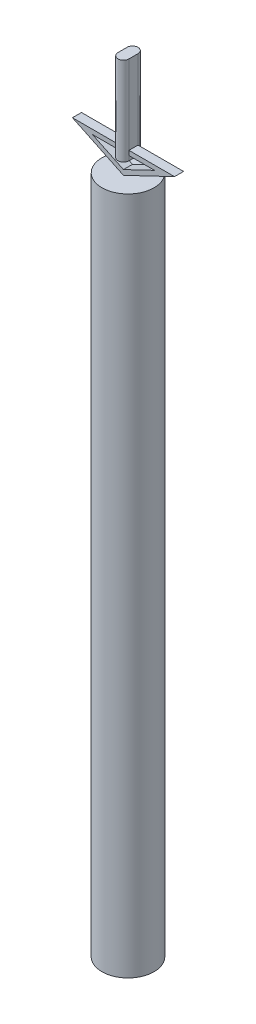
ISO-10303-21;
HEADER;
FILE_DESCRIPTION(('STEP AP214'),'2;1');
FILE_NAME('part.step','',(''),(''),'','','');
FILE_SCHEMA(('AUTOMOTIVE_DESIGN { 1 0 10303 214 1 1 1 1 }'));
ENDSEC;
DATA;
#1=APPLICATION_CONTEXT('core data for automotive mechanical design processes');
#2=APPLICATION_PROTOCOL_DEFINITION('international standard','automotive_design',2000,#1);
#3=PRODUCT_CONTEXT('',#1,'mechanical');
#4=PRODUCT('Part','Part','',(#3));
#5=PRODUCT_RELATED_PRODUCT_CATEGORY('part','',(#4));
#6=PRODUCT_DEFINITION_FORMATION('','',#4);
#7=PRODUCT_DEFINITION_CONTEXT('part definition',#1,'design');
#8=PRODUCT_DEFINITION('design','',#6,#7);
#9=PRODUCT_DEFINITION_SHAPE('','',#8);
#10=(LENGTH_UNIT() NAMED_UNIT(*) SI_UNIT(.MILLI.,.METRE.));
#11=(NAMED_UNIT(*) PLANE_ANGLE_UNIT() SI_UNIT($,.RADIAN.));
#12=(NAMED_UNIT(*) SI_UNIT($,.STERADIAN.) SOLID_ANGLE_UNIT());
#13=UNCERTAINTY_MEASURE_WITH_UNIT(LENGTH_MEASURE(1.E-05),#10,'distance_accuracy_value','');
#14=(GEOMETRIC_REPRESENTATION_CONTEXT(3) GLOBAL_UNCERTAINTY_ASSIGNED_CONTEXT((#13)) GLOBAL_UNIT_ASSIGNED_CONTEXT((#10,
#11,#12)) REPRESENTATION_CONTEXT('',''));
#15=CARTESIAN_POINT('',(0.,0.,0.));
#16=DIRECTION('',(0.,0.,1.));
#17=DIRECTION('',(1.,0.,0.));
#18=AXIS2_PLACEMENT_3D('',#15,#16,#17);
#19=CARTESIAN_POINT('',(-22.5568727923833,310.779030096824,-2.));
#20=DIRECTION('',(0.,1.,0.));
#21=DIRECTION('',(0.,0.,1.));
#22=AXIS2_PLACEMENT_3D('',#19,#20,#21);
#23=PLANE('',#22);
#24=DIRECTION('',(0.,0.,-1.));
#25=VECTOR('',#24,1.);
#26=CARTESIAN_POINT('',(2.42644500089359,310.779030096824,-2.));
#27=LINE('',#26,#25);
#28=CARTESIAN_POINT('',(2.42644500089359,310.779030096824,2.));
#29=VERTEX_POINT('',#28);
#30=CARTESIAN_POINT('',(2.42644500089359,310.779030096824,-2.));
#31=VERTEX_POINT('',#30);
#32=EDGE_CURVE('E205',#29,#31,#27,.T.);
#33=ORIENTED_EDGE('',*,*,#32,.F.);
#34=DIRECTION('',(-1.,0.,0.));
#35=VECTOR('',#34,1.);
#36=CARTESIAN_POINT('',(-22.5568727923833,310.779030096824,2.));
#37=LINE('',#36,#35);
#38=CARTESIAN_POINT('',(22.5568727923833,310.779030096824,2.));
#39=VERTEX_POINT('',#38);
#40=EDGE_CURVE('E221',#39,#29,#37,.T.);
#41=ORIENTED_EDGE('',*,*,#40,.F.);
#42=DIRECTION('',(0.,0.,1.));
#43=VECTOR('',#42,1.);
#44=CARTESIAN_POINT('',(22.5568727923833,310.779030096824,-2.));
#45=LINE('',#44,#43);
#46=CARTESIAN_POINT('',(22.5568727923833,310.779030096824,-2.));
#47=VERTEX_POINT('',#46);
#48=EDGE_CURVE('E254',#47,#39,#45,.T.);
#49=ORIENTED_EDGE('',*,*,#48,.F.);
#50=DIRECTION('',(-1.,0.,0.));
#51=VECTOR('',#50,1.);
#52=CARTESIAN_POINT('',(-22.5568727923833,310.779030096824,-2.));
#53=LINE('',#52,#51);
#54=EDGE_CURVE('E248',#47,#31,#53,.T.);
#55=ORIENTED_EDGE('',*,*,#54,.T.);
#56=EDGE_LOOP('',(#33,#41,#49,#55));
#57=FACE_BOUND('',#56,.T.);
#58=ADVANCED_FACE('F47',(#57),#23,.T.);
#59=CARTESIAN_POINT('',(-13.732911384873,308.779030096824,-2.));
#60=DIRECTION('',(0.,1.,0.));
#61=DIRECTION('',(0.,0.,1.));
#62=AXIS2_PLACEMENT_3D('',#59,#60,#61);
#63=PLANE('',#62);
#64=DIRECTION('',(-1.,0.,0.));
#65=VECTOR('',#64,1.);
#66=CARTESIAN_POINT('',(-13.732911384873,308.779030096824,2.));
#67=LINE('',#66,#65);
#68=CARTESIAN_POINT('',(13.7329113848731,308.779030096824,2.));
#69=VERTEX_POINT('',#68);
#70=CARTESIAN_POINT('',(2.42644500089359,308.779030096824,2.));
#71=VERTEX_POINT('',#70);
#72=EDGE_CURVE('E211',#69,#71,#67,.T.);
#73=ORIENTED_EDGE('',*,*,#72,.T.);
#74=DIRECTION('',(0.,0.,-1.));
#75=VECTOR('',#74,1.);
#76=CARTESIAN_POINT('',(2.42644500089359,308.779030096824,-2.));
#77=LINE('',#76,#75);
#78=CARTESIAN_POINT('',(2.42644500089359,308.779030096824,-2.));
#79=VERTEX_POINT('',#78);
#80=EDGE_CURVE('E202',#71,#79,#77,.T.);
#81=ORIENTED_EDGE('',*,*,#80,.T.);
#82=DIRECTION('',(-1.,0.,0.));
#83=VECTOR('',#82,1.);
#84=CARTESIAN_POINT('',(-13.732911384873,308.779030096824,-2.));
#85=LINE('',#84,#83);
#86=CARTESIAN_POINT('',(13.7329113848731,308.779030096824,-2.));
#87=VERTEX_POINT('',#86);
#88=EDGE_CURVE('E231',#87,#79,#85,.T.);
#89=ORIENTED_EDGE('',*,*,#88,.F.);
#90=DIRECTION('',(0.,0.,1.));
#91=VECTOR('',#90,1.);
#92=CARTESIAN_POINT('',(13.7329113848731,308.779030096824,-2.));
#93=LINE('',#92,#91);
#94=EDGE_CURVE('E237',#87,#69,#93,.T.);
#95=ORIENTED_EDGE('',*,*,#94,.T.);
#96=EDGE_LOOP('',(#73,#81,#89,#95));
#97=FACE_BOUND('',#96,.T.);
#98=ADVANCED_FACE('F284',(#97),#63,.F.);
#99=CARTESIAN_POINT('',(22.5568727923833,310.779030096824,-2.));
#100=DIRECTION('',(0.431161203872958,-0.902274911695333,0.));
#101=DIRECTION('',(0.902274911695333,0.431161203872958,0.));
#102=AXIS2_PLACEMENT_3D('',#99,#100,#101);
#103=PLANE('',#102);
#104=ORIENTED_EDGE('',*,*,#48,.T.);
#105=DIRECTION('',(0.902274911695333,0.431161203872958,0.));
#106=VECTOR('',#105,1.);
#107=CARTESIAN_POINT('',(22.5568727923833,310.779030096824,2.));
#108=LINE('',#107,#106);
#109=CARTESIAN_POINT('',(0.,300.,2.));
#110=VERTEX_POINT('',#109);
#111=EDGE_CURVE('E217',#110,#39,#108,.T.);
#112=ORIENTED_EDGE('',*,*,#111,.F.);
#113=DIRECTION('',(0.,0.,1.));
#114=VECTOR('',#113,1.);
#115=CARTESIAN_POINT('',(0.,300.,-2.));
#116=LINE('',#115,#114);
#117=CARTESIAN_POINT('',(0.,300.,-2.));
#118=VERTEX_POINT('',#117);
#119=EDGE_CURVE('E255',#118,#110,#116,.T.);
#120=ORIENTED_EDGE('',*,*,#119,.F.);
#121=DIRECTION('',(0.902274911695333,0.431161203872958,0.));
#122=VECTOR('',#121,1.);
#123=CARTESIAN_POINT('',(22.5568727923833,310.779030096824,-2.));
#124=LINE('',#123,#122);
#125=EDGE_CURVE('E240',#118,#47,#124,.T.);
#126=ORIENTED_EDGE('',*,*,#125,.T.);
#127=EDGE_LOOP('',(#104,#112,#120,#126));
#128=FACE_BOUND('',#127,.T.);
#129=ADVANCED_FACE('F49',(#128),#103,.T.);
#130=CARTESIAN_POINT('',(0.,300.,-2.));
#131=DIRECTION('',(-0.431161203872958,-0.902274911695333,0.));
#132=DIRECTION('',(0.902274911695333,-0.431161203872958,0.));
#133=AXIS2_PLACEMENT_3D('',#130,#131,#132);
#134=PLANE('',#133);
#135=ORIENTED_EDGE('',*,*,#119,.T.);
#136=DIRECTION('',(0.902274911695333,-0.431161203872958,0.));
#137=VECTOR('',#136,1.);
#138=CARTESIAN_POINT('',(0.,300.,2.));
#139=LINE('',#138,#137);
#140=CARTESIAN_POINT('',(-22.5568727923833,310.779030096824,2.));
#141=VERTEX_POINT('',#140);
#142=EDGE_CURVE('E224',#141,#110,#139,.T.);
#143=ORIENTED_EDGE('',*,*,#142,.F.);
#144=DIRECTION('',(0.,0.,1.));
#145=VECTOR('',#144,1.);
#146=CARTESIAN_POINT('',(-22.5568727923833,310.779030096824,-2.));
#147=LINE('',#146,#145);
#148=CARTESIAN_POINT('',(-22.5568727923833,310.779030096824,-2.));
#149=VERTEX_POINT('',#148);
#150=EDGE_CURVE('E257',#149,#141,#147,.T.);
#151=ORIENTED_EDGE('',*,*,#150,.F.);
#152=DIRECTION('',(0.902274911695333,-0.431161203872958,0.));
#153=VECTOR('',#152,1.);
#154=CARTESIAN_POINT('',(0.,300.,-2.));
#155=LINE('',#154,#153);
#156=EDGE_CURVE('E251',#149,#118,#155,.T.);
#157=ORIENTED_EDGE('',*,*,#156,.T.);
#158=EDGE_LOOP('',(#135,#143,#151,#157));
#159=FACE_BOUND('',#158,.T.);
#160=ADVANCED_FACE('F273',(#159),#134,.T.);
#161=DIRECTION('',(0.,0.,1.));
#162=VECTOR('',#161,1.);
#163=CARTESIAN_POINT('',(-2.42644500089359,310.779030096824,-2.));
#164=LINE('',#163,#162);
#165=CARTESIAN_POINT('',(-2.42644500089359,310.779030096824,-2.));
#166=VERTEX_POINT('',#165);
#167=CARTESIAN_POINT('',(-2.42644500089359,310.779030096824,2.));
#168=VERTEX_POINT('',#167);
#169=EDGE_CURVE('E200',#166,#168,#164,.T.);
#170=ORIENTED_EDGE('',*,*,#169,.F.);
#171=EDGE_CURVE('E247',#166,#149,#53,.T.);
#172=ORIENTED_EDGE('',*,*,#171,.T.);
#173=ORIENTED_EDGE('',*,*,#150,.T.);
#174=EDGE_CURVE('E220',#168,#141,#37,.T.);
#175=ORIENTED_EDGE('',*,*,#174,.F.);
#176=EDGE_LOOP('',(#170,#172,#173,#175));
#177=FACE_BOUND('',#176,.T.);
#178=ADVANCED_FACE('F267',(#177),#23,.T.);
#179=CARTESIAN_POINT('',(0.,0.,-2.));
#180=DIRECTION('',(0.,0.,-1.));
#181=DIRECTION('',(-1.,0.,0.));
#182=AXIS2_PLACEMENT_3D('',#179,#180,#181);
#183=PLANE('',#182);
#184=DIRECTION('',(0.,1.,0.));
#185=VECTOR('',#184,1.);
#186=CARTESIAN_POINT('',(2.42644500089359,306.779030096824,-2.));
#187=LINE('',#186,#185);
#188=EDGE_CURVE('E191',#79,#31,#187,.T.);
#189=ORIENTED_EDGE('',*,*,#188,.T.);
#190=ORIENTED_EDGE('',*,*,#54,.F.);
#191=ORIENTED_EDGE('',*,*,#125,.F.);
#192=ORIENTED_EDGE('',*,*,#156,.F.);
#193=ORIENTED_EDGE('',*,*,#171,.F.);
#194=DIRECTION('',(0.,1.,0.));
#195=VECTOR('',#194,1.);
#196=CARTESIAN_POINT('',(-2.42644500089359,306.779030096824,-2.));
#197=LINE('',#196,#195);
#198=CARTESIAN_POINT('',(-2.42644500089359,308.779030096824,-2.));
#199=VERTEX_POINT('',#198);
#200=EDGE_CURVE('E156',#199,#166,#197,.T.);
#201=ORIENTED_EDGE('',*,*,#200,.F.);
#202=CARTESIAN_POINT('',(-13.732911384873,308.779030096824,-2.));
#203=VERTEX_POINT('',#202);
#204=EDGE_CURVE('E230',#199,#203,#85,.T.);
#205=ORIENTED_EDGE('',*,*,#204,.T.);
#206=DIRECTION('',(0.902274911695333,-0.43116120387296,0.));
#207=VECTOR('',#206,1.);
#208=CARTESIAN_POINT('',(0.,302.216619318653,-2.));
#209=LINE('',#208,#207);
#210=CARTESIAN_POINT('',(0.,302.216619318653,-2.));
#211=VERTEX_POINT('',#210);
#212=EDGE_CURVE('E234',#203,#211,#209,.T.);
#213=ORIENTED_EDGE('',*,*,#212,.T.);
#214=DIRECTION('',(0.902274911695334,0.431161203872957,0.));
#215=VECTOR('',#214,1.);
#216=CARTESIAN_POINT('',(13.7329113848731,308.779030096824,-2.));
#217=LINE('',#216,#215);
#218=EDGE_CURVE('E227',#211,#87,#217,.T.);
#219=ORIENTED_EDGE('',*,*,#218,.T.);
#220=ORIENTED_EDGE('',*,*,#88,.T.);
#221=EDGE_LOOP('',(#189,#190,#191,#192,#193,#201,#205,#213,#219,#220));
#222=FACE_BOUND('',#221,.T.);
#223=ADVANCED_FACE('F302',(#222),#183,.T.);
#224=CARTESIAN_POINT('',(13.7329113848731,308.779030096824,-2.));
#225=DIRECTION('',(0.431161203872957,-0.902274911695334,0.));
#226=DIRECTION('',(0.902274911695334,0.431161203872957,0.));
#227=AXIS2_PLACEMENT_3D('',#224,#225,#226);
#228=PLANE('',#227);
#229=DIRECTION('',(0.,0.,1.));
#230=VECTOR('',#229,1.);
#231=CARTESIAN_POINT('',(0.,302.216619318653,-2.));
#232=LINE('',#231,#230);
#233=CARTESIAN_POINT('',(0.,302.216619318653,2.));
#234=VERTEX_POINT('',#233);
#235=EDGE_CURVE('E238',#211,#234,#232,.T.);
#236=ORIENTED_EDGE('',*,*,#235,.T.);
#237=DIRECTION('',(0.902274911695334,0.431161203872957,0.));
#238=VECTOR('',#237,1.);
#239=CARTESIAN_POINT('',(13.7329113848731,308.779030096824,2.));
#240=LINE('',#239,#238);
#241=EDGE_CURVE('E207',#234,#69,#240,.T.);
#242=ORIENTED_EDGE('',*,*,#241,.T.);
#243=ORIENTED_EDGE('',*,*,#94,.F.);
#244=ORIENTED_EDGE('',*,*,#218,.F.);
#245=EDGE_LOOP('',(#236,#242,#243,#244));
#246=FACE_BOUND('',#245,.T.);
#247=ADVANCED_FACE('F288',(#246),#228,.F.);
#248=CARTESIAN_POINT('',(0.,302.216619318653,-2.));
#249=DIRECTION('',(-0.43116120387296,-0.902274911695333,0.));
#250=DIRECTION('',(0.902274911695333,-0.43116120387296,0.));
#251=AXIS2_PLACEMENT_3D('',#248,#249,#250);
#252=PLANE('',#251);
#253=DIRECTION('',(0.,0.,1.));
#254=VECTOR('',#253,1.);
#255=CARTESIAN_POINT('',(-13.732911384873,308.779030096824,-2.));
#256=LINE('',#255,#254);
#257=CARTESIAN_POINT('',(-13.732911384873,308.779030096824,2.));
#258=VERTEX_POINT('',#257);
#259=EDGE_CURVE('E241',#203,#258,#256,.T.);
#260=ORIENTED_EDGE('',*,*,#259,.T.);
#261=DIRECTION('',(0.902274911695333,-0.43116120387296,0.));
#262=VECTOR('',#261,1.);
#263=CARTESIAN_POINT('',(0.,302.216619318653,2.));
#264=LINE('',#263,#262);
#265=EDGE_CURVE('E214',#258,#234,#264,.T.);
#266=ORIENTED_EDGE('',*,*,#265,.T.);
#267=ORIENTED_EDGE('',*,*,#235,.F.);
#268=ORIENTED_EDGE('',*,*,#212,.F.);
#269=EDGE_LOOP('',(#260,#266,#267,#268));
#270=FACE_BOUND('',#269,.T.);
#271=ADVANCED_FACE('F290',(#270),#252,.F.);
#272=ORIENTED_EDGE('',*,*,#204,.F.);
#273=DIRECTION('',(0.,0.,1.));
#274=VECTOR('',#273,1.);
#275=CARTESIAN_POINT('',(-2.42644500089359,308.779030096824,-2.));
#276=LINE('',#275,#274);
#277=CARTESIAN_POINT('',(-2.42644500089359,308.779030096824,2.));
#278=VERTEX_POINT('',#277);
#279=EDGE_CURVE('E190',#199,#278,#276,.T.);
#280=ORIENTED_EDGE('',*,*,#279,.T.);
#281=EDGE_CURVE('E210',#278,#258,#67,.T.);
#282=ORIENTED_EDGE('',*,*,#281,.T.);
#283=ORIENTED_EDGE('',*,*,#259,.F.);
#284=EDGE_LOOP('',(#272,#280,#282,#283));
#285=FACE_BOUND('',#284,.T.);
#286=ADVANCED_FACE('F295',(#285),#63,.F.);
#287=CARTESIAN_POINT('',(0.,0.,2.));
#288=DIRECTION('',(0.,0.,-1.));
#289=DIRECTION('',(-1.,0.,0.));
#290=AXIS2_PLACEMENT_3D('',#287,#288,#289);
#291=PLANE('',#290);
#292=ORIENTED_EDGE('',*,*,#40,.T.);
#293=DIRECTION('',(0.,1.,0.));
#294=VECTOR('',#293,1.);
#295=CARTESIAN_POINT('',(2.42644500089359,306.779030096824,2.));
#296=LINE('',#295,#294);
#297=EDGE_CURVE('E12',#29,#71,#296,.F.);
#298=ORIENTED_EDGE('',*,*,#297,.T.);
#299=ORIENTED_EDGE('',*,*,#72,.F.);
#300=ORIENTED_EDGE('',*,*,#241,.F.);
#301=ORIENTED_EDGE('',*,*,#265,.F.);
#302=ORIENTED_EDGE('',*,*,#281,.F.);
#303=DIRECTION('',(0.,1.,0.));
#304=VECTOR('',#303,1.);
#305=CARTESIAN_POINT('',(-2.42644500089359,0.,2.));
#306=LINE('',#305,#304);
#307=EDGE_CURVE('E55',#278,#168,#306,.T.);
#308=ORIENTED_EDGE('',*,*,#307,.T.);
#309=ORIENTED_EDGE('',*,*,#174,.T.);
#310=ORIENTED_EDGE('',*,*,#142,.T.);
#311=ORIENTED_EDGE('',*,*,#111,.T.);
#312=EDGE_LOOP('',(#292,#298,#299,#300,#301,#302,#308,#309,#310,#311));
#313=FACE_BOUND('',#312,.T.);
#314=ADVANCED_FACE('F264',(#313),#291,.F.);
#315=CARTESIAN_POINT('',(2.42644500089359,306.779030096824,-2.));
#316=DIRECTION('',(1.,0.,0.));
#317=DIRECTION('',(0.,0.,-1.));
#318=AXIS2_PLACEMENT_3D('',#315,#316,#317);
#319=PLANE('',#318);
#320=ORIENTED_EDGE('',*,*,#80,.F.);
#321=DIRECTION('',(0.,1.,0.));
#322=VECTOR('',#321,1.);
#323=CARTESIAN_POINT('',(2.42644500089359,306.779030096824,2.));
#324=LINE('',#323,#322);
#325=CARTESIAN_POINT('',(2.42644500089359,306.779030096824,2.));
#326=VERTEX_POINT('',#325);
#327=EDGE_CURVE('E62',#326,#71,#324,.T.);
#328=ORIENTED_EDGE('',*,*,#327,.F.);
#329=DIRECTION('',(0.,0.,-1.));
#330=VECTOR('',#329,1.);
#331=CARTESIAN_POINT('',(2.42644500089359,306.779030096824,-2.));
#332=LINE('',#331,#330);
#333=CARTESIAN_POINT('',(2.42644500089359,306.779030096824,-2.));
#334=VERTEX_POINT('',#333);
#335=EDGE_CURVE('E159',#326,#334,#332,.T.);
#336=ORIENTED_EDGE('',*,*,#335,.T.);
#337=EDGE_CURVE('E187',#334,#79,#187,.T.);
#338=ORIENTED_EDGE('',*,*,#337,.T.);
#339=EDGE_LOOP('',(#320,#328,#336,#338));
#340=FACE_BOUND('',#339,.T.);
#341=ADVANCED_FACE('F315',(#340),#319,.T.);
#342=CARTESIAN_POINT('',(-2.42644500089359,306.779030096824,-2.));
#343=DIRECTION('',(-1.,0.,0.));
#344=DIRECTION('',(0.,0.,1.));
#345=AXIS2_PLACEMENT_3D('',#342,#343,#344);
#346=PLANE('',#345);
#347=ORIENTED_EDGE('',*,*,#279,.F.);
#348=CARTESIAN_POINT('',(-2.42644500089359,306.779030096824,-2.));
#349=VERTEX_POINT('',#348);
#350=EDGE_CURVE('E161',#349,#199,#197,.T.);
#351=ORIENTED_EDGE('',*,*,#350,.F.);
#352=DIRECTION('',(0.,0.,1.));
#353=VECTOR('',#352,1.);
#354=CARTESIAN_POINT('',(-2.42644500089359,306.779030096824,-2.));
#355=LINE('',#354,#353);
#356=CARTESIAN_POINT('',(-2.42644500089359,306.779030096824,2.));
#357=VERTEX_POINT('',#356);
#358=EDGE_CURVE('E180',#349,#357,#355,.T.);
#359=ORIENTED_EDGE('',*,*,#358,.T.);
#360=DIRECTION('',(0.,1.,0.));
#361=VECTOR('',#360,1.);
#362=CARTESIAN_POINT('',(-2.42644500089359,306.779030096824,2.));
#363=LINE('',#362,#361);
#364=EDGE_CURVE('E195',#357,#278,#363,.T.);
#365=ORIENTED_EDGE('',*,*,#364,.T.);
#366=EDGE_LOOP('',(#347,#351,#359,#365));
#367=FACE_BOUND('',#366,.T.);
#368=ADVANCED_FACE('F297',(#367),#346,.T.);
#369=CARTESIAN_POINT('',(0.,306.779030096824,-2.));
#370=DIRECTION('',(0.,1.,0.));
#371=DIRECTION('',(0.,0.,1.));
#372=AXIS2_PLACEMENT_3D('',#369,#370,#371);
#373=CYLINDRICAL_SURFACE('',#372,2.42644500089359);
#374=ORIENTED_EDGE('',*,*,#350,.T.);
#375=ORIENTED_EDGE('',*,*,#200,.T.);
#376=CARTESIAN_POINT('',(-2.42644500089359,345.779030096824,-2.));
#377=VERTEX_POINT('',#376);
#378=EDGE_CURVE('E148',#166,#377,#197,.T.);
#379=ORIENTED_EDGE('',*,*,#378,.T.);
#380=CARTESIAN_POINT('',(0.,345.779030096824,-2.));
#381=DIRECTION('',(0.,1.,0.));
#382=DIRECTION('',(0.,0.,1.));
#383=AXIS2_PLACEMENT_3D('',#380,#381,#382);
#384=CIRCLE('',#383,2.42644500089359);
#385=CARTESIAN_POINT('',(2.42644500089359,345.779030096824,-2.));
#386=VERTEX_POINT('',#385);
#387=EDGE_CURVE('E154',#386,#377,#384,.T.);
#388=ORIENTED_EDGE('',*,*,#387,.F.);
#389=EDGE_CURVE('E192',#31,#386,#187,.T.);
#390=ORIENTED_EDGE('',*,*,#389,.F.);
#391=ORIENTED_EDGE('',*,*,#188,.F.);
#392=ORIENTED_EDGE('',*,*,#337,.F.);
#393=CARTESIAN_POINT('',(0.,306.779030096824,-2.));
#394=DIRECTION('',(0.,1.,0.));
#395=DIRECTION('',(0.,0.,1.));
#396=AXIS2_PLACEMENT_3D('',#393,#394,#395);
#397=CIRCLE('',#396,2.42644500089359);
#398=EDGE_CURVE('E177',#334,#349,#397,.T.);
#399=ORIENTED_EDGE('',*,*,#398,.T.);
#400=EDGE_LOOP('',(#374,#375,#379,#388,#390,#391,#392,#399));
#401=FACE_BOUND('',#400,.T.);
#402=ADVANCED_FACE('F151',(#401),#373,.T.);
#403=CARTESIAN_POINT('',(2.42644500089359,345.779030096824,2.));
#404=VERTEX_POINT('',#403);
#405=EDGE_CURVE('E194',#29,#404,#324,.T.);
#406=ORIENTED_EDGE('',*,*,#405,.F.);
#407=ORIENTED_EDGE('',*,*,#32,.T.);
#408=ORIENTED_EDGE('',*,*,#389,.T.);
#409=DIRECTION('',(0.,0.,-1.));
#410=VECTOR('',#409,1.);
#411=CARTESIAN_POINT('',(2.42644500089359,345.779030096824,-2.));
#412=LINE('',#411,#410);
#413=EDGE_CURVE('E172',#404,#386,#412,.T.);
#414=ORIENTED_EDGE('',*,*,#413,.F.);
#415=EDGE_LOOP('',(#406,#407,#408,#414));
#416=FACE_BOUND('',#415,.T.);
#417=ADVANCED_FACE('F304',(#416),#319,.T.);
#418=CARTESIAN_POINT('',(0.,306.779030096824,2.));
#419=DIRECTION('',(0.,1.,0.));
#420=DIRECTION('',(0.,0.,1.));
#421=AXIS2_PLACEMENT_3D('',#418,#419,#420);
#422=CYLINDRICAL_SURFACE('',#421,2.42644500089359);
#423=ORIENTED_EDGE('',*,*,#327,.T.);
#424=ORIENTED_EDGE('',*,*,#297,.F.);
#425=ORIENTED_EDGE('',*,*,#405,.T.);
#426=CARTESIAN_POINT('',(0.,345.779030096824,2.));
#427=DIRECTION('',(0.,1.,0.));
#428=DIRECTION('',(0.,0.,1.));
#429=AXIS2_PLACEMENT_3D('',#426,#427,#428);
#430=CIRCLE('',#429,2.42644500089359);
#431=CARTESIAN_POINT('',(-2.42644500089359,345.779030096824,2.));
#432=VERTEX_POINT('',#431);
#433=EDGE_CURVE('E167',#432,#404,#430,.T.);
#434=ORIENTED_EDGE('',*,*,#433,.F.);
#435=EDGE_CURVE('E69',#168,#432,#363,.T.);
#436=ORIENTED_EDGE('',*,*,#435,.F.);
#437=ORIENTED_EDGE('',*,*,#307,.F.);
#438=ORIENTED_EDGE('',*,*,#364,.F.);
#439=CARTESIAN_POINT('',(0.,306.779030096824,2.));
#440=DIRECTION('',(0.,1.,0.));
#441=DIRECTION('',(0.,0.,1.));
#442=AXIS2_PLACEMENT_3D('',#439,#440,#441);
#443=CIRCLE('',#442,2.42644500089359);
#444=EDGE_CURVE('E183',#357,#326,#443,.T.);
#445=ORIENTED_EDGE('',*,*,#444,.T.);
#446=EDGE_LOOP('',(#423,#424,#425,#434,#436,#437,#438,#445));
#447=FACE_BOUND('',#446,.T.);
#448=ADVANCED_FACE('F305',(#447),#422,.T.);
#449=ORIENTED_EDGE('',*,*,#378,.F.);
#450=ORIENTED_EDGE('',*,*,#169,.T.);
#451=ORIENTED_EDGE('',*,*,#435,.T.);
#452=DIRECTION('',(0.,0.,1.));
#453=VECTOR('',#452,1.);
#454=CARTESIAN_POINT('',(-2.42644500089359,345.779030096824,-2.));
#455=LINE('',#454,#453);
#456=EDGE_CURVE('E163',#377,#432,#455,.T.);
#457=ORIENTED_EDGE('',*,*,#456,.F.);
#458=EDGE_LOOP('',(#449,#450,#451,#457));
#459=FACE_BOUND('',#458,.T.);
#460=ADVANCED_FACE('F164',(#459),#346,.T.);
#461=CARTESIAN_POINT('',(0.,306.779030096824,-2.));
#462=DIRECTION('',(0.,1.,0.));
#463=DIRECTION('',(0.,0.,1.));
#464=AXIS2_PLACEMENT_3D('',#461,#462,#463);
#465=PLANE('',#464);
#466=ORIENTED_EDGE('',*,*,#398,.F.);
#467=ORIENTED_EDGE('',*,*,#335,.F.);
#468=ORIENTED_EDGE('',*,*,#444,.F.);
#469=ORIENTED_EDGE('',*,*,#358,.F.);
#470=EDGE_LOOP('',(#466,#467,#468,#469));
#471=FACE_BOUND('',#470,.T.);
#472=ADVANCED_FACE('F312',(#471),#465,.F.);
#473=CARTESIAN_POINT('',(0.,345.779030096824,-2.));
#474=DIRECTION('',(0.,1.,0.));
#475=DIRECTION('',(0.,0.,1.));
#476=AXIS2_PLACEMENT_3D('',#473,#474,#475);
#477=PLANE('',#476);
#478=ORIENTED_EDGE('',*,*,#387,.T.);
#479=ORIENTED_EDGE('',*,*,#456,.T.);
#480=ORIENTED_EDGE('',*,*,#433,.T.);
#481=ORIENTED_EDGE('',*,*,#413,.T.);
#482=EDGE_LOOP('',(#478,#479,#480,#481));
#483=FACE_BOUND('',#482,.T.);
#484=ADVANCED_FACE('F170',(#483),#477,.T.);
#485=CLOSED_SHELL('',(#58,#98,#129,#160,#178,#223,#247,#271,#286,#314,#341,#368,#402,#417,#448,
#460,#472,#484));
#486=MANIFOLD_SOLID_BREP('B2',#485);
#487=CARTESIAN_POINT('',(0.,300.,0.));
#488=DIRECTION('',(0.,-1.,0.));
#489=DIRECTION('',(0.,0.,-1.));
#490=AXIS2_PLACEMENT_3D('',#487,#488,#489);
#491=CYLINDRICAL_SURFACE('',#490,11.5);
#492=CARTESIAN_POINT('',(0.,300.,0.));
#493=DIRECTION('',(0.,1.,0.));
#494=DIRECTION('',(0.,0.,1.));
#495=AXIS2_PLACEMENT_3D('',#492,#493,#494);
#496=CIRCLE('',#495,11.5);
#497=CARTESIAN_POINT('',(0.,300.,11.5));
#498=VERTEX_POINT('',#497);
#499=EDGE_CURVE('E46',#498,#498,#496,.T.);
#500=ORIENTED_EDGE('',*,*,#499,.F.);
#501=EDGE_LOOP('',(#500));
#502=FACE_BOUND('',#501,.T.);
#503=CARTESIAN_POINT('',(0.,0.,0.));
#504=DIRECTION('',(0.,1.,0.));
#505=DIRECTION('',(0.,0.,1.));
#506=AXIS2_PLACEMENT_3D('',#503,#504,#505);
#507=CIRCLE('',#506,11.5);
#508=CARTESIAN_POINT('',(0.,0.,11.5));
#509=VERTEX_POINT('',#508);
#510=EDGE_CURVE('E456',#509,#509,#507,.T.);
#511=ORIENTED_EDGE('',*,*,#510,.T.);
#512=EDGE_LOOP('',(#511));
#513=FACE_BOUND('',#512,.T.);
#514=ADVANCED_FACE('F453',(#502,#513),#491,.T.);
#515=CARTESIAN_POINT('',(0.,300.,0.));
#516=DIRECTION('',(0.,1.,0.));
#517=DIRECTION('',(0.,0.,1.));
#518=AXIS2_PLACEMENT_3D('',#515,#516,#517);
#519=PLANE('',#518);
#520=ORIENTED_EDGE('',*,*,#499,.T.);
#521=EDGE_LOOP('',(#520));
#522=FACE_BOUND('',#521,.T.);
#523=ADVANCED_FACE('F470',(#522),#519,.T.);
#524=CARTESIAN_POINT('',(0.,0.,0.));
#525=DIRECTION('',(0.,1.,0.));
#526=DIRECTION('',(0.,0.,1.));
#527=AXIS2_PLACEMENT_3D('',#524,#525,#526);
#528=PLANE('',#527);
#529=ORIENTED_EDGE('',*,*,#510,.F.);
#530=EDGE_LOOP('',(#529));
#531=FACE_BOUND('',#530,.T.);
#532=ADVANCED_FACE('F468',(#531),#528,.F.);
#533=CLOSED_SHELL('',(#514,#523,#532));
#534=MANIFOLD_SOLID_BREP('B6',#533);
#535=ADVANCED_BREP_SHAPE_REPRESENTATION('',(#18,#486,#534),#14);
#536=SHAPE_DEFINITION_REPRESENTATION(#9,#535);
ENDSEC;
END-ISO-10303-21;
